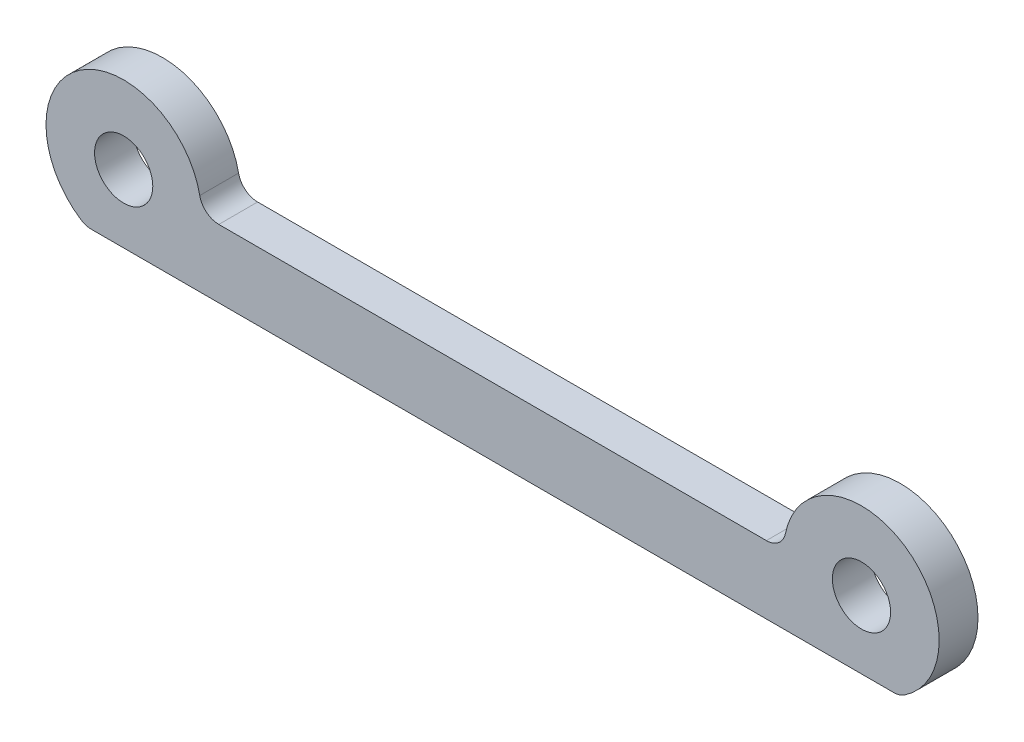
ISO-10303-21;
HEADER;
FILE_DESCRIPTION(('STEP AP214'),'2;1');
FILE_NAME('part.step','',(''),(''),'','','');
FILE_SCHEMA(('AUTOMOTIVE_DESIGN { 1 0 10303 214 1 1 1 1 }'));
ENDSEC;
DATA;
#1=APPLICATION_CONTEXT('core data for automotive mechanical design processes');
#2=APPLICATION_PROTOCOL_DEFINITION('international standard','automotive_design',2000,#1);
#3=PRODUCT_CONTEXT('',#1,'mechanical');
#4=PRODUCT('Part','Part','',(#3));
#5=PRODUCT_RELATED_PRODUCT_CATEGORY('part','',(#4));
#6=PRODUCT_DEFINITION_FORMATION('','',#4);
#7=PRODUCT_DEFINITION_CONTEXT('part definition',#1,'design');
#8=PRODUCT_DEFINITION('design','',#6,#7);
#9=PRODUCT_DEFINITION_SHAPE('','',#8);
#10=(LENGTH_UNIT() NAMED_UNIT(*) SI_UNIT(.MILLI.,.METRE.));
#11=(NAMED_UNIT(*) PLANE_ANGLE_UNIT() SI_UNIT($,.RADIAN.));
#12=(NAMED_UNIT(*) SI_UNIT($,.STERADIAN.) SOLID_ANGLE_UNIT());
#13=UNCERTAINTY_MEASURE_WITH_UNIT(LENGTH_MEASURE(1.E-05),#10,'distance_accuracy_value','');
#14=(GEOMETRIC_REPRESENTATION_CONTEXT(3) GLOBAL_UNCERTAINTY_ASSIGNED_CONTEXT((#13)) GLOBAL_UNIT_ASSIGNED_CONTEXT((#10,
#11,#12)) REPRESENTATION_CONTEXT('',''));
#15=CARTESIAN_POINT('',(0.,0.,0.));
#16=DIRECTION('',(0.,0.,1.));
#17=DIRECTION('',(1.,0.,0.));
#18=AXIS2_PLACEMENT_3D('',#15,#16,#17);
#19=CARTESIAN_POINT('',(19.,3.49999999999997,2.));
#20=DIRECTION('',(0.,0.,-1.));
#21=DIRECTION('',(-1.,0.,0.));
#22=AXIS2_PLACEMENT_3D('',#19,#20,#21);
#23=PLANE('',#22);
#24=CARTESIAN_POINT('',(-19.,3.5,2.));
#25=DIRECTION('',(0.,0.,1.));
#26=DIRECTION('',(1.,0.,0.));
#27=AXIS2_PLACEMENT_3D('',#24,#25,#26);
#28=CIRCLE('',#27,4.);
#29=CARTESIAN_POINT('',(-15.0808164115469,4.3,2.));
#30=VERTEX_POINT('',#29);
#31=CARTESIAN_POINT('',(-21.2110831935703,0.16666666666666,2.));
#32=VERTEX_POINT('',#31);
#33=EDGE_CURVE('E190',#30,#32,#28,.T.);
#34=ORIENTED_EDGE('',*,*,#33,.T.);
#35=CARTESIAN_POINT('',(-20.6583123951777,0.999999999999995,2.));
#36=DIRECTION('',(0.,0.,-1.));
#37=DIRECTION('',(-1.,0.,0.));
#38=AXIS2_PLACEMENT_3D('',#35,#36,#37);
#39=CIRCLE('',#38,1.);
#40=CARTESIAN_POINT('',(-20.6583123951777,0.,2.));
#41=VERTEX_POINT('',#40);
#42=EDGE_CURVE('E158',#32,#41,#39,.F.);
#43=ORIENTED_EDGE('',*,*,#42,.T.);
#44=DIRECTION('',(1.,0.,0.));
#45=VECTOR('',#44,1.);
#46=CARTESIAN_POINT('',(-20.9364916731037,0.,2.));
#47=LINE('',#46,#45);
#48=CARTESIAN_POINT('',(20.6583123951777,0.,2.));
#49=VERTEX_POINT('',#48);
#50=EDGE_CURVE('E127',#41,#49,#47,.T.);
#51=ORIENTED_EDGE('',*,*,#50,.T.);
#52=CARTESIAN_POINT('',(20.6583123951777,0.999999999999968,2.));
#53=DIRECTION('',(0.,0.,-1.));
#54=DIRECTION('',(-1.,0.,0.));
#55=AXIS2_PLACEMENT_3D('',#52,#53,#54);
#56=CIRCLE('',#55,1.);
#57=CARTESIAN_POINT('',(21.2110831935703,0.166666666666637,2.));
#58=VERTEX_POINT('',#57);
#59=EDGE_CURVE('E155',#49,#58,#56,.F.);
#60=ORIENTED_EDGE('',*,*,#59,.T.);
#61=CARTESIAN_POINT('',(19.,3.49999999999997,2.));
#62=DIRECTION('',(0.,0.,1.));
#63=DIRECTION('',(-1.,0.,0.));
#64=AXIS2_PLACEMENT_3D('',#61,#62,#63);
#65=CIRCLE('',#64,4.);
#66=CARTESIAN_POINT('',(15.0808164115469,4.29999999999997,2.));
#67=VERTEX_POINT('',#66);
#68=EDGE_CURVE('E135',#58,#67,#65,.T.);
#69=ORIENTED_EDGE('',*,*,#68,.T.);
#70=CARTESIAN_POINT('',(14.1010205144336,4.49999999999997,2.));
#71=DIRECTION('',(0.,0.,-1.));
#72=DIRECTION('',(-1.,0.,0.));
#73=AXIS2_PLACEMENT_3D('',#70,#71,#72);
#74=CIRCLE('',#73,1.);
#75=CARTESIAN_POINT('',(14.1010205144336,3.49999999999997,2.));
#76=VERTEX_POINT('',#75);
#77=EDGE_CURVE('E62',#67,#76,#74,.T.);
#78=ORIENTED_EDGE('',*,*,#77,.T.);
#79=DIRECTION('',(-1.,0.,0.));
#80=VECTOR('',#79,1.);
#81=CARTESIAN_POINT('',(15.,3.49999999999997,2.));
#82=LINE('',#81,#80);
#83=CARTESIAN_POINT('',(-14.1010205144336,3.5,2.));
#84=VERTEX_POINT('',#83);
#85=EDGE_CURVE('E140',#76,#84,#82,.T.);
#86=ORIENTED_EDGE('',*,*,#85,.T.);
#87=CARTESIAN_POINT('',(-14.1010205144336,4.5,2.));
#88=DIRECTION('',(0.,0.,-1.));
#89=DIRECTION('',(-1.,0.,0.));
#90=AXIS2_PLACEMENT_3D('',#87,#88,#89);
#91=CIRCLE('',#90,1.);
#92=EDGE_CURVE('E11',#84,#30,#91,.T.);
#93=ORIENTED_EDGE('',*,*,#92,.T.);
#94=EDGE_LOOP('',(#34,#43,#51,#60,#69,#78,#86,#93));
#95=FACE_BOUND('',#94,.T.);
#96=CARTESIAN_POINT('',(-19.,3.5,2.));
#97=DIRECTION('',(0.,0.,1.));
#98=DIRECTION('',(1.,0.,0.));
#99=AXIS2_PLACEMENT_3D('',#96,#97,#98);
#100=CIRCLE('',#99,1.5);
#101=CARTESIAN_POINT('',(-17.5,3.5,2.));
#102=VERTEX_POINT('',#101);
#103=EDGE_CURVE('E202',#102,#102,#100,.T.);
#104=ORIENTED_EDGE('',*,*,#103,.F.);
#105=EDGE_LOOP('',(#104));
#106=FACE_BOUND('',#105,.T.);
#107=CARTESIAN_POINT('',(19.,3.49999999999997,2.));
#108=DIRECTION('',(0.,0.,1.));
#109=DIRECTION('',(-1.,0.,0.));
#110=AXIS2_PLACEMENT_3D('',#107,#108,#109);
#111=CIRCLE('',#110,1.5);
#112=CARTESIAN_POINT('',(17.5,3.49999999999997,2.));
#113=VERTEX_POINT('',#112);
#114=EDGE_CURVE('E213',#113,#113,#111,.T.);
#115=ORIENTED_EDGE('',*,*,#114,.F.);
#116=EDGE_LOOP('',(#115));
#117=FACE_BOUND('',#116,.T.);
#118=ADVANCED_FACE('F39',(#95,#106,#117),#23,.F.);
#119=CARTESIAN_POINT('',(19.,3.49999999999997,0.));
#120=DIRECTION('',(0.,0.,-1.));
#121=DIRECTION('',(-1.,0.,0.));
#122=AXIS2_PLACEMENT_3D('',#119,#120,#121);
#123=PLANE('',#122);
#124=CARTESIAN_POINT('',(-19.,3.5,0.));
#125=DIRECTION('',(0.,0.,1.));
#126=DIRECTION('',(1.,0.,0.));
#127=AXIS2_PLACEMENT_3D('',#124,#125,#126);
#128=CIRCLE('',#127,1.5);
#129=CARTESIAN_POINT('',(-17.5,3.5,0.));
#130=VERTEX_POINT('',#129);
#131=EDGE_CURVE('E207',#130,#130,#128,.T.);
#132=ORIENTED_EDGE('',*,*,#131,.T.);
#133=EDGE_LOOP('',(#132));
#134=FACE_BOUND('',#133,.T.);
#135=DIRECTION('',(1.,0.,0.));
#136=VECTOR('',#135,1.);
#137=CARTESIAN_POINT('',(-20.9364916731037,0.,0.));
#138=LINE('',#137,#136);
#139=CARTESIAN_POINT('',(-20.6583123951777,0.,0.));
#140=VERTEX_POINT('',#139);
#141=CARTESIAN_POINT('',(20.6583123951777,0.,0.));
#142=VERTEX_POINT('',#141);
#143=EDGE_CURVE('E124',#140,#142,#138,.T.);
#144=ORIENTED_EDGE('',*,*,#143,.F.);
#145=CARTESIAN_POINT('',(-20.6583123951777,0.999999999999995,0.));
#146=DIRECTION('',(0.,0.,-1.));
#147=DIRECTION('',(-1.,0.,0.));
#148=AXIS2_PLACEMENT_3D('',#145,#146,#147);
#149=CIRCLE('',#148,1.);
#150=CARTESIAN_POINT('',(-21.2110831935703,0.16666666666666,0.));
#151=VERTEX_POINT('',#150);
#152=EDGE_CURVE('E106',#140,#151,#149,.T.);
#153=ORIENTED_EDGE('',*,*,#152,.T.);
#154=CARTESIAN_POINT('',(-19.,3.5,0.));
#155=DIRECTION('',(0.,0.,1.));
#156=DIRECTION('',(1.,0.,0.));
#157=AXIS2_PLACEMENT_3D('',#154,#155,#156);
#158=CIRCLE('',#157,4.);
#159=CARTESIAN_POINT('',(-15.0808164115469,4.3,0.));
#160=VERTEX_POINT('',#159);
#161=EDGE_CURVE('E136',#160,#151,#158,.T.);
#162=ORIENTED_EDGE('',*,*,#161,.F.);
#163=CARTESIAN_POINT('',(-14.1010205144336,4.5,0.));
#164=DIRECTION('',(0.,0.,-1.));
#165=DIRECTION('',(-1.,0.,0.));
#166=AXIS2_PLACEMENT_3D('',#163,#164,#165);
#167=CIRCLE('',#166,1.);
#168=CARTESIAN_POINT('',(-14.1010205144336,3.5,0.));
#169=VERTEX_POINT('',#168);
#170=EDGE_CURVE('E48',#160,#169,#167,.F.);
#171=ORIENTED_EDGE('',*,*,#170,.T.);
#172=DIRECTION('',(-1.,0.,0.));
#173=VECTOR('',#172,1.);
#174=CARTESIAN_POINT('',(15.,3.49999999999997,0.));
#175=LINE('',#174,#173);
#176=CARTESIAN_POINT('',(14.1010205144336,3.49999999999997,0.));
#177=VERTEX_POINT('',#176);
#178=EDGE_CURVE('E142',#177,#169,#175,.T.);
#179=ORIENTED_EDGE('',*,*,#178,.F.);
#180=CARTESIAN_POINT('',(14.1010205144336,4.49999999999997,0.));
#181=DIRECTION('',(0.,0.,-1.));
#182=DIRECTION('',(-1.,0.,0.));
#183=AXIS2_PLACEMENT_3D('',#180,#181,#182);
#184=CIRCLE('',#183,1.);
#185=CARTESIAN_POINT('',(15.0808164115469,4.29999999999997,0.));
#186=VERTEX_POINT('',#185);
#187=EDGE_CURVE('E174',#177,#186,#184,.F.);
#188=ORIENTED_EDGE('',*,*,#187,.T.);
#189=CARTESIAN_POINT('',(19.,3.49999999999997,0.));
#190=DIRECTION('',(0.,0.,1.));
#191=DIRECTION('',(-1.,0.,0.));
#192=AXIS2_PLACEMENT_3D('',#189,#190,#191);
#193=CIRCLE('',#192,4.);
#194=CARTESIAN_POINT('',(21.2110831935703,0.166666666666637,0.));
#195=VERTEX_POINT('',#194);
#196=EDGE_CURVE('E185',#195,#186,#193,.T.);
#197=ORIENTED_EDGE('',*,*,#196,.F.);
#198=CARTESIAN_POINT('',(20.6583123951777,0.999999999999968,0.));
#199=DIRECTION('',(0.,0.,-1.));
#200=DIRECTION('',(-1.,0.,0.));
#201=AXIS2_PLACEMENT_3D('',#198,#199,#200);
#202=CIRCLE('',#201,1.);
#203=EDGE_CURVE('E118',#195,#142,#202,.T.);
#204=ORIENTED_EDGE('',*,*,#203,.T.);
#205=EDGE_LOOP('',(#144,#153,#162,#171,#179,#188,#197,#204));
#206=FACE_BOUND('',#205,.T.);
#207=CARTESIAN_POINT('',(19.,3.49999999999997,0.));
#208=DIRECTION('',(0.,0.,1.));
#209=DIRECTION('',(-1.,0.,0.));
#210=AXIS2_PLACEMENT_3D('',#207,#208,#209);
#211=CIRCLE('',#210,1.5);
#212=CARTESIAN_POINT('',(17.5,3.49999999999997,0.));
#213=VERTEX_POINT('',#212);
#214=EDGE_CURVE('E216',#213,#213,#211,.T.);
#215=ORIENTED_EDGE('',*,*,#214,.T.);
#216=EDGE_LOOP('',(#215));
#217=FACE_BOUND('',#216,.T.);
#218=ADVANCED_FACE('F131',(#134,#206,#217),#123,.T.);
#219=CARTESIAN_POINT('',(19.,3.49999999999997,2.));
#220=DIRECTION('',(0.,0.,-1.));
#221=DIRECTION('',(-1.,0.,0.));
#222=AXIS2_PLACEMENT_3D('',#219,#220,#221);
#223=CYLINDRICAL_SURFACE('',#222,4.);
#224=ORIENTED_EDGE('',*,*,#68,.F.);
#225=DIRECTION('',(0.,0.,-1.));
#226=VECTOR('',#225,1.);
#227=CARTESIAN_POINT('',(21.2110831935703,0.166666666666636,2.));
#228=LINE('',#227,#226);
#229=EDGE_CURVE('E164',#58,#195,#228,.T.);
#230=ORIENTED_EDGE('',*,*,#229,.T.);
#231=ORIENTED_EDGE('',*,*,#196,.T.);
#232=DIRECTION('',(0.,0.,-1.));
#233=VECTOR('',#232,1.);
#234=CARTESIAN_POINT('',(15.0808164115469,4.29999999999997,2.));
#235=LINE('',#234,#233);
#236=EDGE_CURVE('E161',#186,#67,#235,.F.);
#237=ORIENTED_EDGE('',*,*,#236,.T.);
#238=EDGE_LOOP('',(#224,#230,#231,#237));
#239=FACE_BOUND('',#238,.T.);
#240=ADVANCED_FACE('F232',(#239),#223,.T.);
#241=CARTESIAN_POINT('',(15.,3.49999999999997,2.));
#242=DIRECTION('',(0.,-1.,0.));
#243=DIRECTION('',(1.,0.,0.));
#244=AXIS2_PLACEMENT_3D('',#241,#242,#243);
#245=PLANE('',#244);
#246=ORIENTED_EDGE('',*,*,#85,.F.);
#247=DIRECTION('',(0.,0.,1.));
#248=VECTOR('',#247,1.);
#249=CARTESIAN_POINT('',(14.1010205144336,3.49999999999997,0.));
#250=LINE('',#249,#248);
#251=EDGE_CURVE('E170',#76,#177,#250,.F.);
#252=ORIENTED_EDGE('',*,*,#251,.T.);
#253=ORIENTED_EDGE('',*,*,#178,.T.);
#254=DIRECTION('',(0.,0.,1.));
#255=VECTOR('',#254,1.);
#256=CARTESIAN_POINT('',(-14.1010205144336,3.5,2.));
#257=LINE('',#256,#255);
#258=EDGE_CURVE('E55',#169,#84,#257,.T.);
#259=ORIENTED_EDGE('',*,*,#258,.T.);
#260=EDGE_LOOP('',(#246,#252,#253,#259));
#261=FACE_BOUND('',#260,.T.);
#262=ADVANCED_FACE('F182',(#261),#245,.F.);
#263=CARTESIAN_POINT('',(-19.,3.5,2.));
#264=DIRECTION('',(0.,0.,-1.));
#265=DIRECTION('',(-1.,0.,0.));
#266=AXIS2_PLACEMENT_3D('',#263,#264,#265);
#267=CYLINDRICAL_SURFACE('',#266,4.);
#268=ORIENTED_EDGE('',*,*,#161,.T.);
#269=DIRECTION('',(0.,0.,-1.));
#270=VECTOR('',#269,1.);
#271=CARTESIAN_POINT('',(-21.2110831935703,0.16666666666666,2.));
#272=LINE('',#271,#270);
#273=EDGE_CURVE('E111',#151,#32,#272,.F.);
#274=ORIENTED_EDGE('',*,*,#273,.T.);
#275=ORIENTED_EDGE('',*,*,#33,.F.);
#276=DIRECTION('',(0.,0.,-1.));
#277=VECTOR('',#276,1.);
#278=CARTESIAN_POINT('',(-15.0808164115469,4.3,2.));
#279=LINE('',#278,#277);
#280=EDGE_CURVE('E117',#30,#160,#279,.T.);
#281=ORIENTED_EDGE('',*,*,#280,.T.);
#282=EDGE_LOOP('',(#268,#274,#275,#281));
#283=FACE_BOUND('',#282,.T.);
#284=ADVANCED_FACE('F192',(#283),#267,.T.);
#285=CARTESIAN_POINT('',(-20.9364916731037,0.,2.));
#286=DIRECTION('',(0.,1.,0.));
#287=DIRECTION('',(-1.,0.,0.));
#288=AXIS2_PLACEMENT_3D('',#285,#286,#287);
#289=PLANE('',#288);
#290=ORIENTED_EDGE('',*,*,#50,.F.);
#291=DIRECTION('',(0.,0.,-1.));
#292=VECTOR('',#291,1.);
#293=CARTESIAN_POINT('',(-20.6583123951777,0.,2.));
#294=LINE('',#293,#292);
#295=EDGE_CURVE('E110',#41,#140,#294,.T.);
#296=ORIENTED_EDGE('',*,*,#295,.T.);
#297=ORIENTED_EDGE('',*,*,#143,.T.);
#298=DIRECTION('',(0.,0.,-1.));
#299=VECTOR('',#298,1.);
#300=CARTESIAN_POINT('',(20.6583123951777,0.,2.));
#301=LINE('',#300,#299);
#302=EDGE_CURVE('E129',#142,#49,#301,.F.);
#303=ORIENTED_EDGE('',*,*,#302,.T.);
#304=EDGE_LOOP('',(#290,#296,#297,#303));
#305=FACE_BOUND('',#304,.T.);
#306=ADVANCED_FACE('F123',(#305),#289,.F.);
#307=CARTESIAN_POINT('',(-19.,3.5,2.));
#308=DIRECTION('',(0.,0.,-1.));
#309=DIRECTION('',(-1.,0.,0.));
#310=AXIS2_PLACEMENT_3D('',#307,#308,#309);
#311=CYLINDRICAL_SURFACE('',#310,1.5);
#312=ORIENTED_EDGE('',*,*,#103,.T.);
#313=EDGE_LOOP('',(#312));
#314=FACE_BOUND('',#313,.T.);
#315=ORIENTED_EDGE('',*,*,#131,.F.);
#316=EDGE_LOOP('',(#315));
#317=FACE_BOUND('',#316,.T.);
#318=ADVANCED_FACE('F236',(#314,#317),#311,.F.);
#319=CARTESIAN_POINT('',(19.,3.49999999999997,2.));
#320=DIRECTION('',(0.,0.,-1.));
#321=DIRECTION('',(-1.,0.,0.));
#322=AXIS2_PLACEMENT_3D('',#319,#320,#321);
#323=CYLINDRICAL_SURFACE('',#322,1.5);
#324=ORIENTED_EDGE('',*,*,#114,.T.);
#325=EDGE_LOOP('',(#324));
#326=FACE_BOUND('',#325,.T.);
#327=ORIENTED_EDGE('',*,*,#214,.F.);
#328=EDGE_LOOP('',(#327));
#329=FACE_BOUND('',#328,.T.);
#330=ADVANCED_FACE('F224',(#326,#329),#323,.F.);
#331=CARTESIAN_POINT('',(-20.6583123951777,0.999999999999995,2.));
#332=DIRECTION('',(0.,0.,-1.));
#333=DIRECTION('',(-1.,0.,0.));
#334=AXIS2_PLACEMENT_3D('',#331,#332,#333);
#335=CYLINDRICAL_SURFACE('',#334,1.);
#336=ORIENTED_EDGE('',*,*,#42,.F.);
#337=ORIENTED_EDGE('',*,*,#273,.F.);
#338=ORIENTED_EDGE('',*,*,#152,.F.);
#339=ORIENTED_EDGE('',*,*,#295,.F.);
#340=EDGE_LOOP('',(#336,#337,#338,#339));
#341=FACE_BOUND('',#340,.T.);
#342=ADVANCED_FACE('F109',(#341),#335,.T.);
#343=CARTESIAN_POINT('',(20.6583123951777,0.999999999999968,2.));
#344=DIRECTION('',(0.,0.,-1.));
#345=DIRECTION('',(-1.,0.,0.));
#346=AXIS2_PLACEMENT_3D('',#343,#344,#345);
#347=CYLINDRICAL_SURFACE('',#346,1.);
#348=ORIENTED_EDGE('',*,*,#59,.F.);
#349=ORIENTED_EDGE('',*,*,#302,.F.);
#350=ORIENTED_EDGE('',*,*,#203,.F.);
#351=ORIENTED_EDGE('',*,*,#229,.F.);
#352=EDGE_LOOP('',(#348,#349,#350,#351));
#353=FACE_BOUND('',#352,.T.);
#354=ADVANCED_FACE('F249',(#353),#347,.T.);
#355=CARTESIAN_POINT('',(14.1010205144336,4.49999999999997,2.));
#356=DIRECTION('',(0.,0.,-1.));
#357=DIRECTION('',(-1.,0.,0.));
#358=AXIS2_PLACEMENT_3D('',#355,#356,#357);
#359=CYLINDRICAL_SURFACE('',#358,1.);
#360=ORIENTED_EDGE('',*,*,#77,.F.);
#361=ORIENTED_EDGE('',*,*,#236,.F.);
#362=ORIENTED_EDGE('',*,*,#187,.F.);
#363=ORIENTED_EDGE('',*,*,#251,.F.);
#364=EDGE_LOOP('',(#360,#361,#362,#363));
#365=FACE_BOUND('',#364,.T.);
#366=ADVANCED_FACE('F251',(#365),#359,.F.);
#367=CARTESIAN_POINT('',(-14.1010205144336,4.5,2.));
#368=DIRECTION('',(0.,0.,-1.));
#369=DIRECTION('',(-1.,0.,0.));
#370=AXIS2_PLACEMENT_3D('',#367,#368,#369);
#371=CYLINDRICAL_SURFACE('',#370,1.);
#372=ORIENTED_EDGE('',*,*,#92,.F.);
#373=ORIENTED_EDGE('',*,*,#258,.F.);
#374=ORIENTED_EDGE('',*,*,#170,.F.);
#375=ORIENTED_EDGE('',*,*,#280,.F.);
#376=EDGE_LOOP('',(#372,#373,#374,#375));
#377=FACE_BOUND('',#376,.T.);
#378=ADVANCED_FACE('F41',(#377),#371,.F.);
#379=CLOSED_SHELL('',(#118,#218,#240,#262,#284,#306,#318,#330,#342,#354,#366,#378));
#380=MANIFOLD_SOLID_BREP('B2',#379);
#381=ADVANCED_BREP_SHAPE_REPRESENTATION('',(#18,#380),#14);
#382=SHAPE_DEFINITION_REPRESENTATION(#9,#381);
ENDSEC;
END-ISO-10303-21;
